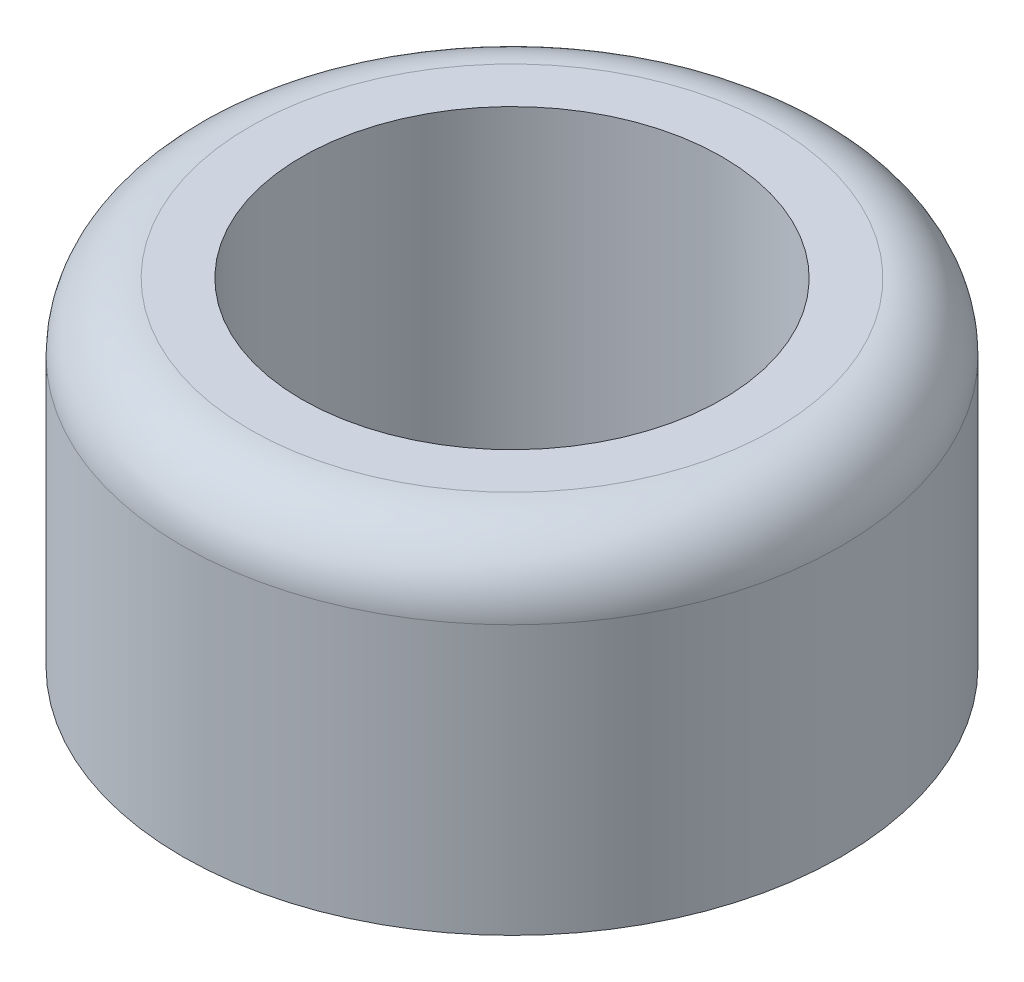
ISO-10303-21;
HEADER;
FILE_DESCRIPTION(('STEP AP214'),'2;1');
FILE_NAME('part.step','',(''),(''),'','','');
FILE_SCHEMA(('AUTOMOTIVE_DESIGN { 1 0 10303 214 1 1 1 1 }'));
ENDSEC;
DATA;
#1=APPLICATION_CONTEXT('core data for automotive mechanical design processes');
#2=APPLICATION_PROTOCOL_DEFINITION('international standard','automotive_design',2000,#1);
#3=PRODUCT_CONTEXT('',#1,'mechanical');
#4=PRODUCT('Part','Part','',(#3));
#5=PRODUCT_RELATED_PRODUCT_CATEGORY('part','',(#4));
#6=PRODUCT_DEFINITION_FORMATION('','',#4);
#7=PRODUCT_DEFINITION_CONTEXT('part definition',#1,'design');
#8=PRODUCT_DEFINITION('design','',#6,#7);
#9=PRODUCT_DEFINITION_SHAPE('','',#8);
#10=(LENGTH_UNIT() NAMED_UNIT(*) SI_UNIT(.MILLI.,.METRE.));
#11=(NAMED_UNIT(*) PLANE_ANGLE_UNIT() SI_UNIT($,.RADIAN.));
#12=(NAMED_UNIT(*) SI_UNIT($,.STERADIAN.) SOLID_ANGLE_UNIT());
#13=UNCERTAINTY_MEASURE_WITH_UNIT(LENGTH_MEASURE(1.E-05),#10,'distance_accuracy_value','');
#14=(GEOMETRIC_REPRESENTATION_CONTEXT(3) GLOBAL_UNCERTAINTY_ASSIGNED_CONTEXT((#13)) GLOBAL_UNIT_ASSIGNED_CONTEXT((#10,
#11,#12)) REPRESENTATION_CONTEXT('',''));
#15=CARTESIAN_POINT('',(0.,0.,0.));
#16=DIRECTION('',(0.,0.,1.));
#17=DIRECTION('',(1.,0.,0.));
#18=AXIS2_PLACEMENT_3D('',#15,#16,#17);
#19=CARTESIAN_POINT('',(0.,5.,0.));
#20=DIRECTION('',(0.,1.,0.));
#21=DIRECTION('',(0.,0.,1.));
#22=AXIS2_PLACEMENT_3D('',#19,#20,#21);
#23=PLANE('',#22);
#24=CARTESIAN_POINT('',(0.,5.,0.));
#25=DIRECTION('',(0.,1.,0.));
#26=DIRECTION('',(0.,0.,1.));
#27=AXIS2_PLACEMENT_3D('',#24,#25,#26);
#28=CIRCLE('',#27,3.9);
#29=CARTESIAN_POINT('',(0.,5.,3.9));
#30=VERTEX_POINT('',#29);
#31=EDGE_CURVE('E40',#30,#30,#28,.T.);
#32=ORIENTED_EDGE('',*,*,#31,.T.);
#33=EDGE_LOOP('',(#32));
#34=FACE_BOUND('',#33,.T.);
#35=CARTESIAN_POINT('',(0.,5.,0.));
#36=DIRECTION('',(0.,1.,0.));
#37=DIRECTION('',(0.,0.,1.));
#38=AXIS2_PLACEMENT_3D('',#35,#36,#37);
#39=CIRCLE('',#38,3.125);
#40=CARTESIAN_POINT('',(0.,5.,3.125));
#41=VERTEX_POINT('',#40);
#42=EDGE_CURVE('E48',#41,#41,#39,.T.);
#43=ORIENTED_EDGE('',*,*,#42,.F.);
#44=EDGE_LOOP('',(#43));
#45=FACE_BOUND('',#44,.T.);
#46=ADVANCED_FACE('F33',(#34,#45),#23,.T.);
#47=CARTESIAN_POINT('',(0.,0.,0.));
#48=DIRECTION('',(0.,1.,0.));
#49=DIRECTION('',(0.,0.,1.));
#50=AXIS2_PLACEMENT_3D('',#47,#48,#49);
#51=PLANE('',#50);
#52=CARTESIAN_POINT('',(0.,0.,0.));
#53=DIRECTION('',(0.,1.,0.));
#54=DIRECTION('',(0.,0.,1.));
#55=AXIS2_PLACEMENT_3D('',#52,#53,#54);
#56=CIRCLE('',#55,4.9);
#57=CARTESIAN_POINT('',(0.,0.,4.9));
#58=VERTEX_POINT('',#57);
#59=EDGE_CURVE('E44',#58,#58,#56,.T.);
#60=ORIENTED_EDGE('',*,*,#59,.F.);
#61=EDGE_LOOP('',(#60));
#62=FACE_BOUND('',#61,.T.);
#63=CARTESIAN_POINT('',(0.,0.,0.));
#64=DIRECTION('',(0.,1.,0.));
#65=DIRECTION('',(0.,0.,1.));
#66=AXIS2_PLACEMENT_3D('',#63,#64,#65);
#67=CIRCLE('',#66,3.125);
#68=CARTESIAN_POINT('',(0.,0.,3.125));
#69=VERTEX_POINT('',#68);
#70=EDGE_CURVE('E51',#69,#69,#67,.T.);
#71=ORIENTED_EDGE('',*,*,#70,.T.);
#72=EDGE_LOOP('',(#71));
#73=FACE_BOUND('',#72,.T.);
#74=ADVANCED_FACE('F61',(#62,#73),#51,.F.);
#75=CARTESIAN_POINT('',(0.,5.,0.));
#76=DIRECTION('',(0.,-1.,0.));
#77=DIRECTION('',(0.,0.,-1.));
#78=AXIS2_PLACEMENT_3D('',#75,#76,#77);
#79=CYLINDRICAL_SURFACE('',#78,4.9);
#80=CARTESIAN_POINT('',(0.,4.,0.));
#81=DIRECTION('',(0.,1.,0.));
#82=DIRECTION('',(0.,0.,1.));
#83=AXIS2_PLACEMENT_3D('',#80,#81,#82);
#84=CIRCLE('',#83,4.9);
#85=CARTESIAN_POINT('',(0.,4.,4.9));
#86=VERTEX_POINT('',#85);
#87=EDGE_CURVE('E10',#86,#86,#84,.F.);
#88=ORIENTED_EDGE('',*,*,#87,.T.);
#89=EDGE_LOOP('',(#88));
#90=FACE_BOUND('',#89,.T.);
#91=ORIENTED_EDGE('',*,*,#59,.T.);
#92=EDGE_LOOP('',(#91));
#93=FACE_BOUND('',#92,.T.);
#94=ADVANCED_FACE('F66',(#90,#93),#79,.T.);
#95=CARTESIAN_POINT('',(0.,5.,0.));
#96=DIRECTION('',(0.,-1.,0.));
#97=DIRECTION('',(0.,0.,-1.));
#98=AXIS2_PLACEMENT_3D('',#95,#96,#97);
#99=CYLINDRICAL_SURFACE('',#98,3.125);
#100=ORIENTED_EDGE('',*,*,#42,.T.);
#101=EDGE_LOOP('',(#100));
#102=FACE_BOUND('',#101,.T.);
#103=ORIENTED_EDGE('',*,*,#70,.F.);
#104=EDGE_LOOP('',(#103));
#105=FACE_BOUND('',#104,.T.);
#106=ADVANCED_FACE('F57',(#102,#105),#99,.F.);
#107=CARTESIAN_POINT('',(0.,4.,0.));
#108=DIRECTION('',(0.,1.,0.));
#109=DIRECTION('',(0.,0.,1.));
#110=AXIS2_PLACEMENT_3D('',#107,#108,#109);
#111=TOROIDAL_SURFACE('',#110,3.9,1.);
#112=ORIENTED_EDGE('',*,*,#87,.F.);
#113=EDGE_LOOP('',(#112));
#114=FACE_BOUND('',#113,.T.);
#115=ORIENTED_EDGE('',*,*,#31,.F.);
#116=EDGE_LOOP('',(#115));
#117=FACE_BOUND('',#116,.T.);
#118=ADVANCED_FACE('F35',(#114,#117),#111,.T.);
#119=CLOSED_SHELL('',(#46,#74,#94,#106,#118));
#120=MANIFOLD_SOLID_BREP('B2',#119);
#121=ADVANCED_BREP_SHAPE_REPRESENTATION('',(#18,#120),#14);
#122=SHAPE_DEFINITION_REPRESENTATION(#9,#121);
ENDSEC;
END-ISO-10303-21;
